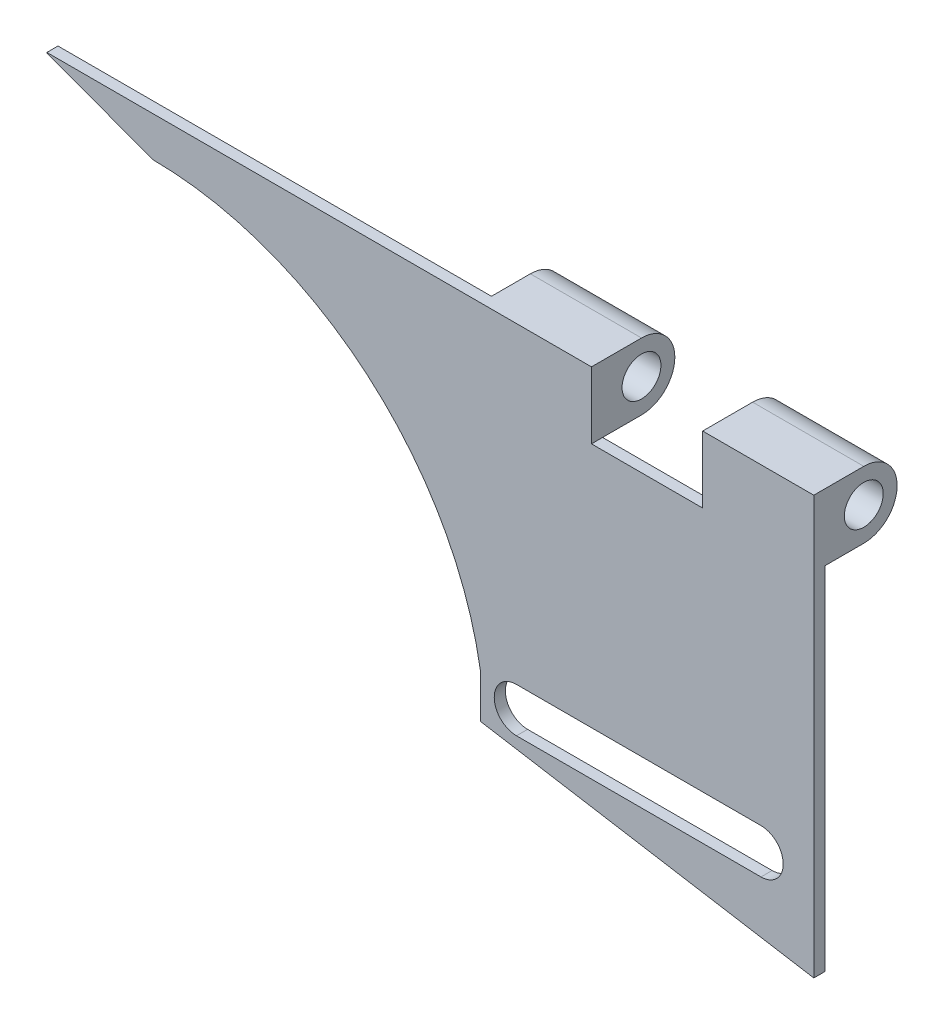
ISO-10303-21;
HEADER;
FILE_DESCRIPTION(('STEP AP214'),'2;1');
FILE_NAME('part.step','',(''),(''),'','','');
FILE_SCHEMA(('AUTOMOTIVE_DESIGN { 1 0 10303 214 1 1 1 1 }'));
ENDSEC;
DATA;
#1=APPLICATION_CONTEXT('core data for automotive mechanical design processes');
#2=APPLICATION_PROTOCOL_DEFINITION('international standard','automotive_design',2000,#1);
#3=PRODUCT_CONTEXT('',#1,'mechanical');
#4=PRODUCT('Part','Part','',(#3));
#5=PRODUCT_RELATED_PRODUCT_CATEGORY('part','',(#4));
#6=PRODUCT_DEFINITION_FORMATION('','',#4);
#7=PRODUCT_DEFINITION_CONTEXT('part definition',#1,'design');
#8=PRODUCT_DEFINITION('design','',#6,#7);
#9=PRODUCT_DEFINITION_SHAPE('','',#8);
#10=(LENGTH_UNIT() NAMED_UNIT(*) SI_UNIT(.MILLI.,.METRE.));
#11=(NAMED_UNIT(*) PLANE_ANGLE_UNIT() SI_UNIT($,.RADIAN.));
#12=(NAMED_UNIT(*) SI_UNIT($,.STERADIAN.) SOLID_ANGLE_UNIT());
#13=UNCERTAINTY_MEASURE_WITH_UNIT(LENGTH_MEASURE(1.E-05),#10,'distance_accuracy_value','');
#14=(GEOMETRIC_REPRESENTATION_CONTEXT(3) GLOBAL_UNCERTAINTY_ASSIGNED_CONTEXT((#13)) GLOBAL_UNIT_ASSIGNED_CONTEXT((#10,
#11,#12)) REPRESENTATION_CONTEXT('',''));
#15=CARTESIAN_POINT('',(0.,0.,0.));
#16=DIRECTION('',(0.,0.,1.));
#17=DIRECTION('',(1.,0.,0.));
#18=AXIS2_PLACEMENT_3D('',#15,#16,#17);
#19=CARTESIAN_POINT('',(-34.5,18.81,1.));
#20=DIRECTION('',(0.,1.,0.));
#21=DIRECTION('',(-1.,0.,0.));
#22=AXIS2_PLACEMENT_3D('',#19,#20,#21);
#23=PLANE('',#22);
#24=DIRECTION('',(1.,0.,0.));
#25=VECTOR('',#24,1.);
#26=CARTESIAN_POINT('',(-34.5,18.81,1.));
#27=LINE('',#26,#25);
#28=CARTESIAN_POINT('',(-34.5,18.81,1.));
#29=VERTEX_POINT('',#28);
#30=CARTESIAN_POINT('',(14.5,18.81,1.));
#31=VERTEX_POINT('',#30);
#32=EDGE_CURVE('E191',#29,#31,#27,.T.);
#33=ORIENTED_EDGE('',*,*,#32,.T.);
#34=DIRECTION('',(0.,0.,1.));
#35=VECTOR('',#34,1.);
#36=CARTESIAN_POINT('',(14.5,18.81,0.));
#37=LINE('',#36,#35);
#38=CARTESIAN_POINT('',(14.5,18.81,-3.5));
#39=VERTEX_POINT('',#38);
#40=EDGE_CURVE('E400',#39,#31,#37,.T.);
#41=ORIENTED_EDGE('',*,*,#40,.F.);
#42=DIRECTION('',(1.,0.,0.));
#43=VECTOR('',#42,1.);
#44=CARTESIAN_POINT('',(4.5,18.81,-3.5));
#45=LINE('',#44,#43);
#46=CARTESIAN_POINT('',(4.5,18.81,-3.5));
#47=VERTEX_POINT('',#46);
#48=EDGE_CURVE('E227',#47,#39,#45,.T.);
#49=ORIENTED_EDGE('',*,*,#48,.F.);
#50=DIRECTION('',(0.,0.,1.));
#51=VECTOR('',#50,1.);
#52=CARTESIAN_POINT('',(4.5,18.81,0.));
#53=LINE('',#52,#51);
#54=CARTESIAN_POINT('',(4.5,18.81,0.));
#55=VERTEX_POINT('',#54);
#56=EDGE_CURVE('E406',#47,#55,#53,.T.);
#57=ORIENTED_EDGE('',*,*,#56,.T.);
#58=DIRECTION('',(1.,0.,0.));
#59=VECTOR('',#58,1.);
#60=CARTESIAN_POINT('',(-34.5,18.81,0.));
#61=LINE('',#60,#59);
#62=CARTESIAN_POINT('',(-34.5,18.81,0.));
#63=VERTEX_POINT('',#62);
#64=EDGE_CURVE('E210',#63,#55,#61,.T.);
#65=ORIENTED_EDGE('',*,*,#64,.F.);
#66=DIRECTION('',(0.,0.,-1.));
#67=VECTOR('',#66,1.);
#68=CARTESIAN_POINT('',(-34.5,18.81,1.));
#69=LINE('',#68,#67);
#70=EDGE_CURVE('E207',#29,#63,#69,.T.);
#71=ORIENTED_EDGE('',*,*,#70,.F.);
#72=EDGE_LOOP('',(#33,#41,#49,#57,#65,#71));
#73=FACE_BOUND('',#72,.T.);
#74=ADVANCED_FACE('F34',(#73),#23,.T.);
#75=CARTESIAN_POINT('',(-25.0856136994558,-14.7790504149759,0.));
#76=DIRECTION('',(0.,0.,-1.));
#77=DIRECTION('',(-1.,0.,0.));
#78=AXIS2_PLACEMENT_3D('',#75,#76,#77);
#79=PLANE('',#78);
#80=DIRECTION('',(-1.,0.,0.));
#81=VECTOR('',#80,1.);
#82=CARTESIAN_POINT('',(24.5,12.81,0.));
#83=LINE('',#82,#81);
#84=CARTESIAN_POINT('',(24.5,12.81,0.));
#85=VERTEX_POINT('',#84);
#86=CARTESIAN_POINT('',(14.5,12.81,0.));
#87=VERTEX_POINT('',#86);
#88=EDGE_CURVE('E381',#85,#87,#83,.T.);
#89=ORIENTED_EDGE('',*,*,#88,.F.);
#90=DIRECTION('',(1.,0.,0.));
#91=VECTOR('',#90,1.);
#92=CARTESIAN_POINT('',(24.5,12.81,0.));
#93=LINE('',#92,#91);
#94=CARTESIAN_POINT('',(34.5,12.81,0.));
#95=VERTEX_POINT('',#94);
#96=EDGE_CURVE('E173',#85,#95,#93,.T.);
#97=ORIENTED_EDGE('',*,*,#96,.T.);
#98=DIRECTION('',(0.,-1.,0.));
#99=VECTOR('',#98,1.);
#100=CARTESIAN_POINT('',(34.5,18.81,0.));
#101=LINE('',#100,#99);
#102=CARTESIAN_POINT('',(34.5,-18.81,0.));
#103=VERTEX_POINT('',#102);
#104=EDGE_CURVE('E219',#95,#103,#101,.T.);
#105=ORIENTED_EDGE('',*,*,#104,.T.);
#106=DIRECTION('',(0.986393923832144,-0.164398987305357,0.));
#107=VECTOR('',#106,1.);
#108=CARTESIAN_POINT('',(4.5,-13.81,0.));
#109=LINE('',#108,#107);
#110=CARTESIAN_POINT('',(4.5,-13.81,0.));
#111=VERTEX_POINT('',#110);
#112=EDGE_CURVE('E222',#111,#103,#109,.T.);
#113=ORIENTED_EDGE('',*,*,#112,.F.);
#114=DIRECTION('',(0.,1.,0.));
#115=VECTOR('',#114,1.);
#116=CARTESIAN_POINT('',(4.5,-13.81,0.));
#117=LINE('',#116,#115);
#118=CARTESIAN_POINT('',(4.5,-9.81,0.));
#119=VERTEX_POINT('',#118);
#120=EDGE_CURVE('E453',#111,#119,#117,.T.);
#121=ORIENTED_EDGE('',*,*,#120,.T.);
#122=CARTESIAN_POINT('',(-25.0856136994558,-14.7790504149759,0.));
#123=DIRECTION('',(0.,0.,-1.));
#124=DIRECTION('',(-1.,0.,0.));
#125=AXIS2_PLACEMENT_3D('',#122,#123,#124);
#126=CIRCLE('',#125,30.);
#127=CARTESIAN_POINT('',(-24.9542795391054,15.2206621059521,0.));
#128=VERTEX_POINT('',#127);
#129=EDGE_CURVE('E195',#128,#119,#126,.T.);
#130=ORIENTED_EDGE('',*,*,#129,.F.);
#131=DIRECTION('',(0.937451280255772,-0.348116499388947,0.));
#132=VECTOR('',#131,1.);
#133=CARTESIAN_POINT('',(-15.2795240321348,11.6280039161722,0.));
#134=LINE('',#133,#132);
#135=CARTESIAN_POINT('',(-34.5,18.7654039618547,0.));
#136=VERTEX_POINT('',#135);
#137=EDGE_CURVE('E56',#128,#136,#134,.F.);
#138=ORIENTED_EDGE('',*,*,#137,.T.);
#139=DIRECTION('',(0.,1.,0.));
#140=VECTOR('',#139,1.);
#141=CARTESIAN_POINT('',(-34.5,14.81,0.));
#142=LINE('',#141,#140);
#143=EDGE_CURVE('E208',#136,#63,#142,.T.);
#144=ORIENTED_EDGE('',*,*,#143,.T.);
#145=ORIENTED_EDGE('',*,*,#64,.T.);
#146=DIRECTION('',(0.,-1.,0.));
#147=VECTOR('',#146,1.);
#148=CARTESIAN_POINT('',(4.5,18.81,0.));
#149=LINE('',#148,#147);
#150=CARTESIAN_POINT('',(4.5,12.81,0.));
#151=VERTEX_POINT('',#150);
#152=EDGE_CURVE('E397',#55,#151,#149,.T.);
#153=ORIENTED_EDGE('',*,*,#152,.T.);
#154=DIRECTION('',(1.,0.,0.));
#155=VECTOR('',#154,1.);
#156=CARTESIAN_POINT('',(4.5,12.81,0.));
#157=LINE('',#156,#155);
#158=EDGE_CURVE('E409',#151,#87,#157,.T.);
#159=ORIENTED_EDGE('',*,*,#158,.T.);
#160=EDGE_LOOP('',(#89,#97,#105,#113,#121,#130,#138,#144,#145,#153,#159));
#161=FACE_BOUND('',#160,.T.);
#162=CARTESIAN_POINT('',(7.75,-11.31,0.));
#163=DIRECTION('',(0.,0.,1.));
#164=DIRECTION('',(1.,0.,0.));
#165=AXIS2_PLACEMENT_3D('',#162,#163,#164);
#166=CIRCLE('',#165,2.);
#167=CARTESIAN_POINT('',(7.75,-9.31,0.));
#168=VERTEX_POINT('',#167);
#169=CARTESIAN_POINT('',(7.75,-13.31,0.));
#170=VERTEX_POINT('',#169);
#171=EDGE_CURVE('E238',#168,#170,#166,.T.);
#172=ORIENTED_EDGE('',*,*,#171,.T.);
#173=DIRECTION('',(1.,0.,0.));
#174=VECTOR('',#173,1.);
#175=CARTESIAN_POINT('',(29.75,-13.31,0.));
#176=LINE('',#175,#174);
#177=CARTESIAN_POINT('',(29.75,-13.31,0.));
#178=VERTEX_POINT('',#177);
#179=EDGE_CURVE('E241',#170,#178,#176,.T.);
#180=ORIENTED_EDGE('',*,*,#179,.T.);
#181=CARTESIAN_POINT('',(29.75,-11.31,0.));
#182=DIRECTION('',(0.,0.,1.));
#183=DIRECTION('',(-1.,0.,0.));
#184=AXIS2_PLACEMENT_3D('',#181,#182,#183);
#185=CIRCLE('',#184,2.);
#186=CARTESIAN_POINT('',(29.75,-9.31,0.));
#187=VERTEX_POINT('',#186);
#188=EDGE_CURVE('E245',#178,#187,#185,.T.);
#189=ORIENTED_EDGE('',*,*,#188,.T.);
#190=DIRECTION('',(-1.,0.,0.));
#191=VECTOR('',#190,1.);
#192=CARTESIAN_POINT('',(7.75,-9.31,0.));
#193=LINE('',#192,#191);
#194=EDGE_CURVE('E248',#187,#168,#193,.T.);
#195=ORIENTED_EDGE('',*,*,#194,.T.);
#196=EDGE_LOOP('',(#172,#180,#189,#195));
#197=FACE_BOUND('',#196,.T.);
#198=ADVANCED_FACE('F282',(#161,#197),#79,.T.);
#199=CARTESIAN_POINT('',(-34.5,14.81,1.));
#200=DIRECTION('',(-1.,0.,0.));
#201=DIRECTION('',(0.,0.,1.));
#202=AXIS2_PLACEMENT_3D('',#199,#200,#201);
#203=PLANE('',#202);
#204=ORIENTED_EDGE('',*,*,#143,.F.);
#205=DIRECTION('',(0.,0.,1.));
#206=VECTOR('',#205,1.);
#207=CARTESIAN_POINT('',(-34.5,18.7654039618547,1.));
#208=LINE('',#207,#206);
#209=CARTESIAN_POINT('',(-34.5,18.7654039618547,1.));
#210=VERTEX_POINT('',#209);
#211=EDGE_CURVE('E42',#136,#210,#208,.T.);
#212=ORIENTED_EDGE('',*,*,#211,.T.);
#213=DIRECTION('',(0.,1.,0.));
#214=VECTOR('',#213,1.);
#215=CARTESIAN_POINT('',(-34.5,14.81,1.));
#216=LINE('',#215,#214);
#217=EDGE_CURVE('E192',#210,#29,#216,.T.);
#218=ORIENTED_EDGE('',*,*,#217,.T.);
#219=ORIENTED_EDGE('',*,*,#70,.T.);
#220=EDGE_LOOP('',(#204,#212,#218,#219));
#221=FACE_BOUND('',#220,.T.);
#222=ADVANCED_FACE('F301',(#221),#203,.T.);
#223=CARTESIAN_POINT('',(-25.0856136994558,-14.7790504149759,1.));
#224=DIRECTION('',(0.,0.,-1.));
#225=DIRECTION('',(-1.,0.,0.));
#226=AXIS2_PLACEMENT_3D('',#223,#224,#225);
#227=CYLINDRICAL_SURFACE('',#226,30.);
#228=CARTESIAN_POINT('',(-25.0856136994558,-14.7790504149759,1.));
#229=DIRECTION('',(0.,0.,-1.));
#230=DIRECTION('',(-1.,0.,0.));
#231=AXIS2_PLACEMENT_3D('',#228,#229,#230);
#232=CIRCLE('',#231,30.);
#233=CARTESIAN_POINT('',(-24.9542795391054,15.2206621059521,1.));
#234=VERTEX_POINT('',#233);
#235=CARTESIAN_POINT('',(4.5,-9.81,1.));
#236=VERTEX_POINT('',#235);
#237=EDGE_CURVE('E205',#234,#236,#232,.T.);
#238=ORIENTED_EDGE('',*,*,#237,.F.);
#239=DIRECTION('',(0.,0.,-1.));
#240=VECTOR('',#239,1.);
#241=CARTESIAN_POINT('',(-24.9542795391054,15.2206621059521,1.));
#242=LINE('',#241,#240);
#243=EDGE_CURVE('E451',#234,#128,#242,.T.);
#244=ORIENTED_EDGE('',*,*,#243,.T.);
#245=ORIENTED_EDGE('',*,*,#129,.T.);
#246=DIRECTION('',(0.,0.,-1.));
#247=VECTOR('',#246,1.);
#248=CARTESIAN_POINT('',(4.5,-9.81,1.));
#249=LINE('',#248,#247);
#250=EDGE_CURVE('E448',#236,#119,#249,.T.);
#251=ORIENTED_EDGE('',*,*,#250,.F.);
#252=EDGE_LOOP('',(#238,#244,#245,#251));
#253=FACE_BOUND('',#252,.T.);
#254=ADVANCED_FACE('F324',(#253),#227,.F.);
#255=CARTESIAN_POINT('',(4.5,-13.81,1.));
#256=DIRECTION('',(-1.,0.,0.));
#257=DIRECTION('',(0.,-1.,0.));
#258=AXIS2_PLACEMENT_3D('',#255,#256,#257);
#259=PLANE('',#258);
#260=ORIENTED_EDGE('',*,*,#120,.F.);
#261=DIRECTION('',(0.,0.,-1.));
#262=VECTOR('',#261,1.);
#263=CARTESIAN_POINT('',(4.5,-13.81,1.));
#264=LINE('',#263,#262);
#265=CARTESIAN_POINT('',(4.5,-13.81,1.));
#266=VERTEX_POINT('',#265);
#267=EDGE_CURVE('E444',#266,#111,#264,.T.);
#268=ORIENTED_EDGE('',*,*,#267,.F.);
#269=DIRECTION('',(0.,1.,0.));
#270=VECTOR('',#269,1.);
#271=CARTESIAN_POINT('',(4.5,-13.81,1.));
#272=LINE('',#271,#270);
#273=EDGE_CURVE('E202',#266,#236,#272,.T.);
#274=ORIENTED_EDGE('',*,*,#273,.T.);
#275=ORIENTED_EDGE('',*,*,#250,.T.);
#276=EDGE_LOOP('',(#260,#268,#274,#275));
#277=FACE_BOUND('',#276,.T.);
#278=ADVANCED_FACE('F316',(#277),#259,.T.);
#279=CARTESIAN_POINT('',(4.5,-13.81,1.));
#280=DIRECTION('',(0.164398987305357,0.986393923832144,0.));
#281=DIRECTION('',(-0.986393923832144,0.164398987305357,0.));
#282=AXIS2_PLACEMENT_3D('',#279,#280,#281);
#283=PLANE('',#282);
#284=ORIENTED_EDGE('',*,*,#112,.T.);
#285=DIRECTION('',(0.,0.,-1.));
#286=VECTOR('',#285,1.);
#287=CARTESIAN_POINT('',(34.5,-18.81,1.));
#288=LINE('',#287,#286);
#289=CARTESIAN_POINT('',(34.5,-18.81,1.));
#290=VERTEX_POINT('',#289);
#291=EDGE_CURVE('E430',#290,#103,#288,.T.);
#292=ORIENTED_EDGE('',*,*,#291,.F.);
#293=DIRECTION('',(0.986393923832144,-0.164398987305357,0.));
#294=VECTOR('',#293,1.);
#295=CARTESIAN_POINT('',(4.5,-13.81,1.));
#296=LINE('',#295,#294);
#297=EDGE_CURVE('E200',#266,#290,#296,.T.);
#298=ORIENTED_EDGE('',*,*,#297,.F.);
#299=ORIENTED_EDGE('',*,*,#267,.T.);
#300=EDGE_LOOP('',(#284,#292,#298,#299));
#301=FACE_BOUND('',#300,.T.);
#302=ADVANCED_FACE('F311',(#301),#283,.F.);
#303=CARTESIAN_POINT('',(34.5,18.81,1.));
#304=DIRECTION('',(1.,0.,0.));
#305=DIRECTION('',(0.,0.,-1.));
#306=AXIS2_PLACEMENT_3D('',#303,#304,#305);
#307=PLANE('',#306);
#308=CARTESIAN_POINT('',(34.5,15.81,-3.5));
#309=DIRECTION('',(1.,0.,0.));
#310=DIRECTION('',(0.,0.,-1.));
#311=AXIS2_PLACEMENT_3D('',#308,#309,#310);
#312=CIRCLE('',#311,1.75);
#313=CARTESIAN_POINT('',(34.5,15.81,-5.25));
#314=VERTEX_POINT('',#313);
#315=EDGE_CURVE('E184',#314,#314,#312,.T.);
#316=ORIENTED_EDGE('',*,*,#315,.F.);
#317=EDGE_LOOP('',(#316));
#318=FACE_BOUND('',#317,.T.);
#319=ORIENTED_EDGE('',*,*,#104,.F.);
#320=DIRECTION('',(0.,0.,-1.));
#321=VECTOR('',#320,1.);
#322=CARTESIAN_POINT('',(34.5,12.81,0.));
#323=LINE('',#322,#321);
#324=CARTESIAN_POINT('',(34.5,12.81,-3.5));
#325=VERTEX_POINT('',#324);
#326=EDGE_CURVE('E223',#95,#325,#323,.T.);
#327=ORIENTED_EDGE('',*,*,#326,.T.);
#328=CARTESIAN_POINT('',(34.5,15.81,-3.5));
#329=DIRECTION('',(1.,0.,0.));
#330=DIRECTION('',(0.,0.,1.));
#331=AXIS2_PLACEMENT_3D('',#328,#329,#330);
#332=CIRCLE('',#331,3.);
#333=CARTESIAN_POINT('',(34.5,18.81,-3.5));
#334=VERTEX_POINT('',#333);
#335=EDGE_CURVE('E226',#325,#334,#332,.T.);
#336=ORIENTED_EDGE('',*,*,#335,.T.);
#337=DIRECTION('',(0.,0.,-1.));
#338=VECTOR('',#337,1.);
#339=CARTESIAN_POINT('',(34.5,18.81,1.));
#340=LINE('',#339,#338);
#341=CARTESIAN_POINT('',(34.5,18.81,1.));
#342=VERTEX_POINT('',#341);
#343=EDGE_CURVE('E443',#342,#334,#340,.T.);
#344=ORIENTED_EDGE('',*,*,#343,.F.);
#345=DIRECTION('',(0.,-1.,0.));
#346=VECTOR('',#345,1.);
#347=CARTESIAN_POINT('',(34.5,18.81,1.));
#348=LINE('',#347,#346);
#349=EDGE_CURVE('E190',#342,#290,#348,.T.);
#350=ORIENTED_EDGE('',*,*,#349,.T.);
#351=ORIENTED_EDGE('',*,*,#291,.T.);
#352=EDGE_LOOP('',(#319,#327,#336,#344,#350,#351));
#353=FACE_BOUND('',#352,.T.);
#354=ADVANCED_FACE('F305',(#318,#353),#307,.T.);
#355=DIRECTION('',(0.,0.,1.));
#356=VECTOR('',#355,1.);
#357=CARTESIAN_POINT('',(24.5,18.81,0.));
#358=LINE('',#357,#356);
#359=CARTESIAN_POINT('',(24.5,18.81,-3.5));
#360=VERTEX_POINT('',#359);
#361=CARTESIAN_POINT('',(24.5,18.81,1.));
#362=VERTEX_POINT('',#361);
#363=EDGE_CURVE('E162',#360,#362,#358,.T.);
#364=ORIENTED_EDGE('',*,*,#363,.T.);
#365=EDGE_CURVE('E166',#362,#342,#27,.T.);
#366=ORIENTED_EDGE('',*,*,#365,.T.);
#367=ORIENTED_EDGE('',*,*,#343,.T.);
#368=DIRECTION('',(1.,0.,0.));
#369=VECTOR('',#368,1.);
#370=CARTESIAN_POINT('',(24.5,18.81,-3.5));
#371=LINE('',#370,#369);
#372=EDGE_CURVE('E169',#360,#334,#371,.T.);
#373=ORIENTED_EDGE('',*,*,#372,.F.);
#374=EDGE_LOOP('',(#364,#366,#367,#373));
#375=FACE_BOUND('',#374,.T.);
#376=ADVANCED_FACE('F164',(#375),#23,.T.);
#377=CARTESIAN_POINT('',(-25.0856136994558,-14.7790504149759,1.));
#378=DIRECTION('',(0.,0.,-1.));
#379=DIRECTION('',(-1.,0.,0.));
#380=AXIS2_PLACEMENT_3D('',#377,#378,#379);
#381=PLANE('',#380);
#382=DIRECTION('',(1.,0.,0.));
#383=VECTOR('',#382,1.);
#384=CARTESIAN_POINT('',(29.75,-13.31,1.));
#385=LINE('',#384,#383);
#386=CARTESIAN_POINT('',(7.75000000000001,-13.31,1.));
#387=VERTEX_POINT('',#386);
#388=CARTESIAN_POINT('',(29.75,-13.31,1.));
#389=VERTEX_POINT('',#388);
#390=EDGE_CURVE('E254',#387,#389,#385,.T.);
#391=ORIENTED_EDGE('',*,*,#390,.F.);
#392=CARTESIAN_POINT('',(7.75,-11.31,1.));
#393=DIRECTION('',(0.,0.,1.));
#394=DIRECTION('',(1.,0.,0.));
#395=AXIS2_PLACEMENT_3D('',#392,#393,#394);
#396=CIRCLE('',#395,2.);
#397=CARTESIAN_POINT('',(7.75,-9.31,1.));
#398=VERTEX_POINT('',#397);
#399=EDGE_CURVE('E252',#398,#387,#396,.T.);
#400=ORIENTED_EDGE('',*,*,#399,.F.);
#401=DIRECTION('',(-1.,0.,0.));
#402=VECTOR('',#401,1.);
#403=CARTESIAN_POINT('',(7.75,-9.31,1.));
#404=LINE('',#403,#402);
#405=CARTESIAN_POINT('',(29.75,-9.31,1.));
#406=VERTEX_POINT('',#405);
#407=EDGE_CURVE('E242',#406,#398,#404,.T.);
#408=ORIENTED_EDGE('',*,*,#407,.F.);
#409=CARTESIAN_POINT('',(29.75,-11.31,1.));
#410=DIRECTION('',(0.,0.,1.));
#411=DIRECTION('',(-1.,0.,0.));
#412=AXIS2_PLACEMENT_3D('',#409,#410,#411);
#413=CIRCLE('',#412,2.);
#414=EDGE_CURVE('E257',#389,#406,#413,.T.);
#415=ORIENTED_EDGE('',*,*,#414,.F.);
#416=EDGE_LOOP('',(#391,#400,#408,#415));
#417=FACE_BOUND('',#416,.T.);
#418=DIRECTION('',(1.,0.,0.));
#419=VECTOR('',#418,1.);
#420=CARTESIAN_POINT('',(24.5,12.81,1.));
#421=LINE('',#420,#419);
#422=CARTESIAN_POINT('',(14.5,12.81,1.));
#423=VERTEX_POINT('',#422);
#424=CARTESIAN_POINT('',(24.5,12.81,1.));
#425=VERTEX_POINT('',#424);
#426=EDGE_CURVE('E374',#423,#425,#421,.T.);
#427=ORIENTED_EDGE('',*,*,#426,.F.);
#428=DIRECTION('',(0.,-1.,0.));
#429=VECTOR('',#428,1.);
#430=CARTESIAN_POINT('',(14.5,12.81,1.));
#431=LINE('',#430,#429);
#432=EDGE_CURVE('E379',#31,#423,#431,.T.);
#433=ORIENTED_EDGE('',*,*,#432,.F.);
#434=ORIENTED_EDGE('',*,*,#32,.F.);
#435=ORIENTED_EDGE('',*,*,#217,.F.);
#436=DIRECTION('',(-0.937451280255772,0.348116499388947,0.));
#437=VECTOR('',#436,1.);
#438=CARTESIAN_POINT('',(-24.9542795391054,15.2206621059521,1.));
#439=LINE('',#438,#437);
#440=EDGE_CURVE('E11',#210,#234,#439,.F.);
#441=ORIENTED_EDGE('',*,*,#440,.T.);
#442=ORIENTED_EDGE('',*,*,#237,.T.);
#443=ORIENTED_EDGE('',*,*,#273,.F.);
#444=ORIENTED_EDGE('',*,*,#297,.T.);
#445=ORIENTED_EDGE('',*,*,#349,.F.);
#446=ORIENTED_EDGE('',*,*,#365,.F.);
#447=DIRECTION('',(0.,1.,0.));
#448=VECTOR('',#447,1.);
#449=CARTESIAN_POINT('',(24.5,18.81,1.));
#450=LINE('',#449,#448);
#451=EDGE_CURVE('E177',#425,#362,#450,.T.);
#452=ORIENTED_EDGE('',*,*,#451,.F.);
#453=EDGE_LOOP('',(#427,#433,#434,#435,#441,#442,#443,#444,#445,#446,#452));
#454=FACE_BOUND('',#453,.T.);
#455=ADVANCED_FACE('F188',(#417,#454),#381,.F.);
#456=CARTESIAN_POINT('',(7.75,-11.31,0.));
#457=DIRECTION('',(0.,0.,1.));
#458=DIRECTION('',(1.,0.,0.));
#459=AXIS2_PLACEMENT_3D('',#456,#457,#458);
#460=CYLINDRICAL_SURFACE('',#459,2.);
#461=ORIENTED_EDGE('',*,*,#399,.T.);
#462=DIRECTION('',(0.,0.,1.));
#463=VECTOR('',#462,1.);
#464=CARTESIAN_POINT('',(7.75,-13.31,0.));
#465=LINE('',#464,#463);
#466=EDGE_CURVE('E251',#170,#387,#465,.T.);
#467=ORIENTED_EDGE('',*,*,#466,.F.);
#468=ORIENTED_EDGE('',*,*,#171,.F.);
#469=DIRECTION('',(0.,0.,1.));
#470=VECTOR('',#469,1.);
#471=CARTESIAN_POINT('',(7.75,-9.31,0.));
#472=LINE('',#471,#470);
#473=EDGE_CURVE('E211',#168,#398,#472,.T.);
#474=ORIENTED_EDGE('',*,*,#473,.T.);
#475=EDGE_LOOP('',(#461,#467,#468,#474));
#476=FACE_BOUND('',#475,.T.);
#477=ADVANCED_FACE('F283',(#476),#460,.F.);
#478=CARTESIAN_POINT('',(7.75,-9.31,0.));
#479=DIRECTION('',(0.,1.,0.));
#480=DIRECTION('',(0.,0.,1.));
#481=AXIS2_PLACEMENT_3D('',#478,#479,#480);
#482=PLANE('',#481);
#483=ORIENTED_EDGE('',*,*,#407,.T.);
#484=ORIENTED_EDGE('',*,*,#473,.F.);
#485=ORIENTED_EDGE('',*,*,#194,.F.);
#486=DIRECTION('',(0.,0.,1.));
#487=VECTOR('',#486,1.);
#488=CARTESIAN_POINT('',(29.75,-9.31,0.));
#489=LINE('',#488,#487);
#490=EDGE_CURVE('E263',#187,#406,#489,.T.);
#491=ORIENTED_EDGE('',*,*,#490,.T.);
#492=EDGE_LOOP('',(#483,#484,#485,#491));
#493=FACE_BOUND('',#492,.T.);
#494=ADVANCED_FACE('F285',(#493),#482,.F.);
#495=CARTESIAN_POINT('',(29.75,-11.31,0.));
#496=DIRECTION('',(0.,0.,1.));
#497=DIRECTION('',(1.,0.,0.));
#498=AXIS2_PLACEMENT_3D('',#495,#496,#497);
#499=CYLINDRICAL_SURFACE('',#498,2.);
#500=ORIENTED_EDGE('',*,*,#414,.T.);
#501=ORIENTED_EDGE('',*,*,#490,.F.);
#502=ORIENTED_EDGE('',*,*,#188,.F.);
#503=DIRECTION('',(0.,0.,1.));
#504=VECTOR('',#503,1.);
#505=CARTESIAN_POINT('',(29.75,-13.31,0.));
#506=LINE('',#505,#504);
#507=EDGE_CURVE('E265',#178,#389,#506,.T.);
#508=ORIENTED_EDGE('',*,*,#507,.T.);
#509=EDGE_LOOP('',(#500,#501,#502,#508));
#510=FACE_BOUND('',#509,.T.);
#511=ADVANCED_FACE('F279',(#510),#499,.F.);
#512=CARTESIAN_POINT('',(29.75,-13.31,0.));
#513=DIRECTION('',(0.,-1.,0.));
#514=DIRECTION('',(1.,0.,0.));
#515=AXIS2_PLACEMENT_3D('',#512,#513,#514);
#516=PLANE('',#515);
#517=ORIENTED_EDGE('',*,*,#390,.T.);
#518=ORIENTED_EDGE('',*,*,#507,.F.);
#519=ORIENTED_EDGE('',*,*,#179,.F.);
#520=ORIENTED_EDGE('',*,*,#466,.T.);
#521=EDGE_LOOP('',(#517,#518,#519,#520));
#522=FACE_BOUND('',#521,.T.);
#523=ADVANCED_FACE('F270',(#522),#516,.F.);
#524=CARTESIAN_POINT('',(24.5,15.81,-3.5));
#525=DIRECTION('',(1.,0.,0.));
#526=DIRECTION('',(0.,0.,-1.));
#527=AXIS2_PLACEMENT_3D('',#524,#525,#526);
#528=CYLINDRICAL_SURFACE('',#527,3.);
#529=ORIENTED_EDGE('',*,*,#335,.F.);
#530=DIRECTION('',(1.,0.,0.));
#531=VECTOR('',#530,1.);
#532=CARTESIAN_POINT('',(24.5,12.81,-3.5));
#533=LINE('',#532,#531);
#534=CARTESIAN_POINT('',(24.5,12.81,-3.5));
#535=VERTEX_POINT('',#534);
#536=EDGE_CURVE('E232',#535,#325,#533,.T.);
#537=ORIENTED_EDGE('',*,*,#536,.F.);
#538=CARTESIAN_POINT('',(24.5,15.81,-3.5));
#539=DIRECTION('',(1.,0.,0.));
#540=DIRECTION('',(0.,0.,1.));
#541=AXIS2_PLACEMENT_3D('',#538,#539,#540);
#542=CIRCLE('',#541,3.);
#543=EDGE_CURVE('E174',#535,#360,#542,.T.);
#544=ORIENTED_EDGE('',*,*,#543,.T.);
#545=ORIENTED_EDGE('',*,*,#372,.T.);
#546=EDGE_LOOP('',(#529,#537,#544,#545));
#547=FACE_BOUND('',#546,.T.);
#548=ADVANCED_FACE('F330',(#547),#528,.T.);
#549=CARTESIAN_POINT('',(24.5,12.81,0.));
#550=DIRECTION('',(0.,-1.,0.));
#551=DIRECTION('',(0.,0.,-1.));
#552=AXIS2_PLACEMENT_3D('',#549,#550,#551);
#553=PLANE('',#552);
#554=ORIENTED_EDGE('',*,*,#326,.F.);
#555=ORIENTED_EDGE('',*,*,#96,.F.);
#556=DIRECTION('',(0.,0.,-1.));
#557=VECTOR('',#556,1.);
#558=CARTESIAN_POINT('',(24.5,12.81,0.));
#559=LINE('',#558,#557);
#560=EDGE_CURVE('E421',#85,#535,#559,.T.);
#561=ORIENTED_EDGE('',*,*,#560,.T.);
#562=ORIENTED_EDGE('',*,*,#536,.T.);
#563=EDGE_LOOP('',(#554,#555,#561,#562));
#564=FACE_BOUND('',#563,.T.);
#565=ADVANCED_FACE('F334',(#564),#553,.T.);
#566=CARTESIAN_POINT('',(24.5,15.81,-3.5));
#567=DIRECTION('',(-1.,0.,0.));
#568=DIRECTION('',(0.,0.,1.));
#569=AXIS2_PLACEMENT_3D('',#566,#567,#568);
#570=PLANE('',#569);
#571=CARTESIAN_POINT('',(24.5,15.81,-3.5));
#572=DIRECTION('',(-1.,0.,0.));
#573=DIRECTION('',(0.,0.,1.));
#574=AXIS2_PLACEMENT_3D('',#571,#572,#573);
#575=CIRCLE('',#574,1.75);
#576=CARTESIAN_POINT('',(24.5,15.81,-1.75));
#577=VERTEX_POINT('',#576);
#578=EDGE_CURVE('E393',#577,#577,#575,.T.);
#579=ORIENTED_EDGE('',*,*,#578,.F.);
#580=EDGE_LOOP('',(#579));
#581=FACE_BOUND('',#580,.T.);
#582=ORIENTED_EDGE('',*,*,#560,.F.);
#583=DIRECTION('',(0.,0.,-1.));
#584=VECTOR('',#583,1.);
#585=CARTESIAN_POINT('',(24.5,12.81,1.001));
#586=LINE('',#585,#584);
#587=EDGE_CURVE('E180',#425,#85,#586,.T.);
#588=ORIENTED_EDGE('',*,*,#587,.F.);
#589=ORIENTED_EDGE('',*,*,#451,.T.);
#590=ORIENTED_EDGE('',*,*,#363,.F.);
#591=ORIENTED_EDGE('',*,*,#543,.F.);
#592=EDGE_LOOP('',(#582,#588,#589,#590,#591));
#593=FACE_BOUND('',#592,.T.);
#594=ADVANCED_FACE('F179',(#581,#593),#570,.T.);
#595=CARTESIAN_POINT('',(4.5,15.81,-3.5));
#596=DIRECTION('',(1.,0.,0.));
#597=DIRECTION('',(0.,0.,-1.));
#598=AXIS2_PLACEMENT_3D('',#595,#596,#597);
#599=CYLINDRICAL_SURFACE('',#598,3.);
#600=CARTESIAN_POINT('',(14.5,15.81,-3.5));
#601=DIRECTION('',(1.,0.,0.));
#602=DIRECTION('',(0.,0.,1.));
#603=AXIS2_PLACEMENT_3D('',#600,#601,#602);
#604=CIRCLE('',#603,3.);
#605=CARTESIAN_POINT('',(14.5,12.81,-3.5));
#606=VERTEX_POINT('',#605);
#607=EDGE_CURVE('E412',#606,#39,#604,.T.);
#608=ORIENTED_EDGE('',*,*,#607,.F.);
#609=DIRECTION('',(1.,0.,0.));
#610=VECTOR('',#609,1.);
#611=CARTESIAN_POINT('',(4.5,12.81,-3.5));
#612=LINE('',#611,#610);
#613=CARTESIAN_POINT('',(4.5,12.81,-3.5));
#614=VERTEX_POINT('',#613);
#615=EDGE_CURVE('E417',#614,#606,#612,.T.);
#616=ORIENTED_EDGE('',*,*,#615,.F.);
#617=CARTESIAN_POINT('',(4.5,15.81,-3.5));
#618=DIRECTION('',(1.,0.,0.));
#619=DIRECTION('',(0.,0.,1.));
#620=AXIS2_PLACEMENT_3D('',#617,#618,#619);
#621=CIRCLE('',#620,3.);
#622=EDGE_CURVE('E403',#614,#47,#621,.T.);
#623=ORIENTED_EDGE('',*,*,#622,.T.);
#624=ORIENTED_EDGE('',*,*,#48,.T.);
#625=EDGE_LOOP('',(#608,#616,#623,#624));
#626=FACE_BOUND('',#625,.T.);
#627=ADVANCED_FACE('F345',(#626),#599,.T.);
#628=CARTESIAN_POINT('',(4.5,12.81,0.));
#629=DIRECTION('',(0.,-1.,0.));
#630=DIRECTION('',(0.,0.,-1.));
#631=AXIS2_PLACEMENT_3D('',#628,#629,#630);
#632=PLANE('',#631);
#633=DIRECTION('',(0.,0.,-1.));
#634=VECTOR('',#633,1.);
#635=CARTESIAN_POINT('',(14.5,12.81,0.));
#636=LINE('',#635,#634);
#637=EDGE_CURVE('E396',#87,#606,#636,.T.);
#638=ORIENTED_EDGE('',*,*,#637,.F.);
#639=ORIENTED_EDGE('',*,*,#158,.F.);
#640=DIRECTION('',(0.,0.,-1.));
#641=VECTOR('',#640,1.);
#642=CARTESIAN_POINT('',(4.5,12.81,0.));
#643=LINE('',#642,#641);
#644=EDGE_CURVE('E399',#151,#614,#643,.T.);
#645=ORIENTED_EDGE('',*,*,#644,.T.);
#646=ORIENTED_EDGE('',*,*,#615,.T.);
#647=EDGE_LOOP('',(#638,#639,#645,#646));
#648=FACE_BOUND('',#647,.T.);
#649=ADVANCED_FACE('F347',(#648),#632,.T.);
#650=CARTESIAN_POINT('',(4.5,15.81,-3.5));
#651=DIRECTION('',(-1.,0.,0.));
#652=DIRECTION('',(0.,0.,1.));
#653=AXIS2_PLACEMENT_3D('',#650,#651,#652);
#654=PLANE('',#653);
#655=CARTESIAN_POINT('',(4.5,15.81,-3.5));
#656=DIRECTION('',(-1.,0.,0.));
#657=DIRECTION('',(0.,0.,1.));
#658=AXIS2_PLACEMENT_3D('',#655,#656,#657);
#659=CIRCLE('',#658,1.75);
#660=CARTESIAN_POINT('',(4.5,15.81,-1.75));
#661=VERTEX_POINT('',#660);
#662=EDGE_CURVE('E389',#661,#661,#659,.F.);
#663=ORIENTED_EDGE('',*,*,#662,.T.);
#664=EDGE_LOOP('',(#663));
#665=FACE_BOUND('',#664,.T.);
#666=ORIENTED_EDGE('',*,*,#152,.F.);
#667=ORIENTED_EDGE('',*,*,#56,.F.);
#668=ORIENTED_EDGE('',*,*,#622,.F.);
#669=ORIENTED_EDGE('',*,*,#644,.F.);
#670=EDGE_LOOP('',(#666,#667,#668,#669));
#671=FACE_BOUND('',#670,.T.);
#672=ADVANCED_FACE('F350',(#665,#671),#654,.T.);
#673=CARTESIAN_POINT('',(14.5,15.81,-3.5));
#674=DIRECTION('',(-1.,0.,0.));
#675=DIRECTION('',(0.,0.,1.));
#676=AXIS2_PLACEMENT_3D('',#673,#674,#675);
#677=PLANE('',#676);
#678=CARTESIAN_POINT('',(14.5,15.81,-3.5));
#679=DIRECTION('',(-1.,0.,0.));
#680=DIRECTION('',(0.,0.,1.));
#681=AXIS2_PLACEMENT_3D('',#678,#679,#680);
#682=CIRCLE('',#681,1.75);
#683=CARTESIAN_POINT('',(14.5,15.81,-1.75));
#684=VERTEX_POINT('',#683);
#685=EDGE_CURVE('E392',#684,#684,#682,.T.);
#686=ORIENTED_EDGE('',*,*,#685,.T.);
#687=EDGE_LOOP('',(#686));
#688=FACE_BOUND('',#687,.T.);
#689=ORIENTED_EDGE('',*,*,#40,.T.);
#690=ORIENTED_EDGE('',*,*,#432,.T.);
#691=DIRECTION('',(0.,0.,-1.));
#692=VECTOR('',#691,1.);
#693=CARTESIAN_POINT('',(14.5,12.81,1.001));
#694=LINE('',#693,#692);
#695=EDGE_CURVE('E185',#423,#87,#694,.T.);
#696=ORIENTED_EDGE('',*,*,#695,.T.);
#697=ORIENTED_EDGE('',*,*,#637,.T.);
#698=ORIENTED_EDGE('',*,*,#607,.T.);
#699=EDGE_LOOP('',(#689,#690,#696,#697,#698));
#700=FACE_BOUND('',#699,.T.);
#701=ADVANCED_FACE('F355',(#688,#700),#677,.F.);
#702=CARTESIAN_POINT('',(-0.449747468305839,15.81,-3.5));
#703=DIRECTION('',(1.,0.,0.));
#704=DIRECTION('',(0.,0.,-1.));
#705=AXIS2_PLACEMENT_3D('',#702,#703,#704);
#706=CYLINDRICAL_SURFACE('',#705,1.75);
#707=ORIENTED_EDGE('',*,*,#662,.F.);
#708=EDGE_LOOP('',(#707));
#709=FACE_BOUND('',#708,.T.);
#710=ORIENTED_EDGE('',*,*,#685,.F.);
#711=EDGE_LOOP('',(#710));
#712=FACE_BOUND('',#711,.T.);
#713=ADVANCED_FACE('F358',(#709,#712),#706,.F.);
#714=ORIENTED_EDGE('',*,*,#578,.T.);
#715=EDGE_LOOP('',(#714));
#716=FACE_BOUND('',#715,.T.);
#717=ORIENTED_EDGE('',*,*,#315,.T.);
#718=EDGE_LOOP('',(#717));
#719=FACE_BOUND('',#718,.T.);
#720=ADVANCED_FACE('F363',(#716,#719),#706,.F.);
#721=CARTESIAN_POINT('',(-24.9542795391054,15.2206621059521,1.));
#722=DIRECTION('',(0.348116499388947,0.937451280255772,0.));
#723=DIRECTION('',(0.,0.,-1.));
#724=AXIS2_PLACEMENT_3D('',#721,#722,#723);
#725=PLANE('',#724);
#726=ORIENTED_EDGE('',*,*,#440,.F.);
#727=ORIENTED_EDGE('',*,*,#211,.F.);
#728=ORIENTED_EDGE('',*,*,#137,.F.);
#729=ORIENTED_EDGE('',*,*,#243,.F.);
#730=EDGE_LOOP('',(#726,#727,#728,#729));
#731=FACE_BOUND('',#730,.T.);
#732=ADVANCED_FACE('F36',(#731),#725,.F.);
#733=CARTESIAN_POINT('',(24.5,12.81,1.001));
#734=DIRECTION('',(0.,-1.,0.));
#735=DIRECTION('',(1.,0.,0.));
#736=AXIS2_PLACEMENT_3D('',#733,#734,#735);
#737=PLANE('',#736);
#738=ORIENTED_EDGE('',*,*,#426,.T.);
#739=ORIENTED_EDGE('',*,*,#587,.T.);
#740=ORIENTED_EDGE('',*,*,#88,.T.);
#741=ORIENTED_EDGE('',*,*,#695,.F.);
#742=EDGE_LOOP('',(#738,#739,#740,#741));
#743=FACE_BOUND('',#742,.T.);
#744=ADVANCED_FACE('F367',(#743),#737,.F.);
#745=CLOSED_SHELL('',(#74,#198,#222,#254,#278,#302,#354,#376,#455,#477,#494,#511,#523,#548,#565,
#594,#627,#649,#672,#701,#713,#720,#732,#744));
#746=MANIFOLD_SOLID_BREP('B2',#745);
#747=ADVANCED_BREP_SHAPE_REPRESENTATION('',(#18,#746),#14);
#748=SHAPE_DEFINITION_REPRESENTATION(#9,#747);
ENDSEC;
END-ISO-10303-21;
